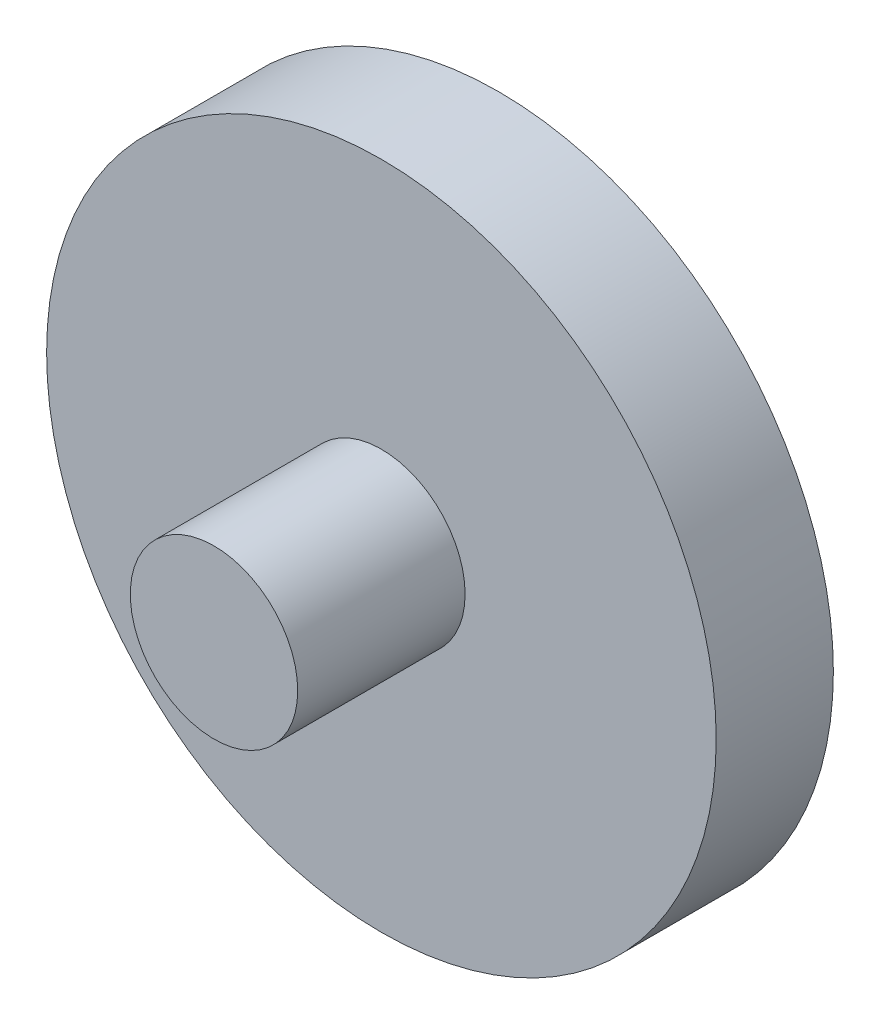
ISO-10303-21;
HEADER;
FILE_DESCRIPTION(('STEP AP214'),'2;1');
FILE_NAME('part.step','',(''),(''),'','','');
FILE_SCHEMA(('AUTOMOTIVE_DESIGN { 1 0 10303 214 1 1 1 1 }'));
ENDSEC;
DATA;
#1=APPLICATION_CONTEXT('core data for automotive mechanical design processes');
#2=APPLICATION_PROTOCOL_DEFINITION('international standard','automotive_design',2000,#1);
#3=PRODUCT_CONTEXT('',#1,'mechanical');
#4=PRODUCT('Part','Part','',(#3));
#5=PRODUCT_RELATED_PRODUCT_CATEGORY('part','',(#4));
#6=PRODUCT_DEFINITION_FORMATION('','',#4);
#7=PRODUCT_DEFINITION_CONTEXT('part definition',#1,'design');
#8=PRODUCT_DEFINITION('design','',#6,#7);
#9=PRODUCT_DEFINITION_SHAPE('','',#8);
#10=(LENGTH_UNIT() NAMED_UNIT(*) SI_UNIT(.MILLI.,.METRE.));
#11=(NAMED_UNIT(*) PLANE_ANGLE_UNIT() SI_UNIT($,.RADIAN.));
#12=(NAMED_UNIT(*) SI_UNIT($,.STERADIAN.) SOLID_ANGLE_UNIT());
#13=UNCERTAINTY_MEASURE_WITH_UNIT(LENGTH_MEASURE(1.E-05),#10,'distance_accuracy_value','');
#14=(GEOMETRIC_REPRESENTATION_CONTEXT(3) GLOBAL_UNCERTAINTY_ASSIGNED_CONTEXT((#13)) GLOBAL_UNIT_ASSIGNED_CONTEXT((#10,
#11,#12)) REPRESENTATION_CONTEXT('',''));
#15=CARTESIAN_POINT('',(0.,0.,0.));
#16=DIRECTION('',(0.,0.,1.));
#17=DIRECTION('',(1.,0.,0.));
#18=AXIS2_PLACEMENT_3D('',#15,#16,#17);
#19=CARTESIAN_POINT('',(0.,0.,7.));
#20=DIRECTION('',(0.,0.,-1.));
#21=DIRECTION('',(-1.,0.,0.));
#22=AXIS2_PLACEMENT_3D('',#19,#20,#21);
#23=CYLINDRICAL_SURFACE('',#22,20.);
#24=CARTESIAN_POINT('',(0.,0.,7.));
#25=DIRECTION('',(0.,0.,1.));
#26=DIRECTION('',(1.,0.,0.));
#27=AXIS2_PLACEMENT_3D('',#24,#25,#26);
#28=CIRCLE('',#27,20.);
#29=CARTESIAN_POINT('',(20.,0.,7.));
#30=VERTEX_POINT('',#29);
#31=EDGE_CURVE('E10',#30,#30,#28,.T.);
#32=ORIENTED_EDGE('',*,*,#31,.F.);
#33=EDGE_LOOP('',(#32));
#34=FACE_BOUND('',#33,.T.);
#35=CARTESIAN_POINT('',(0.,0.,0.));
#36=DIRECTION('',(0.,0.,1.));
#37=DIRECTION('',(1.,0.,0.));
#38=AXIS2_PLACEMENT_3D('',#35,#36,#37);
#39=CIRCLE('',#38,20.);
#40=CARTESIAN_POINT('',(20.,0.,0.));
#41=VERTEX_POINT('',#40);
#42=EDGE_CURVE('E34',#41,#41,#39,.T.);
#43=ORIENTED_EDGE('',*,*,#42,.T.);
#44=EDGE_LOOP('',(#43));
#45=FACE_BOUND('',#44,.T.);
#46=ADVANCED_FACE('F31',(#34,#45),#23,.T.);
#47=CARTESIAN_POINT('',(0.,0.,7.));
#48=DIRECTION('',(0.,0.,1.));
#49=DIRECTION('',(1.,0.,0.));
#50=AXIS2_PLACEMENT_3D('',#47,#48,#49);
#51=PLANE('',#50);
#52=CARTESIAN_POINT('',(0.,0.,7.));
#53=DIRECTION('',(0.,0.,1.));
#54=DIRECTION('',(1.,0.,0.));
#55=AXIS2_PLACEMENT_3D('',#52,#53,#54);
#56=CIRCLE('',#55,5.);
#57=CARTESIAN_POINT('',(5.,0.,7.));
#58=VERTEX_POINT('',#57);
#59=EDGE_CURVE('E43',#58,#58,#56,.T.);
#60=ORIENTED_EDGE('',*,*,#59,.F.);
#61=EDGE_LOOP('',(#60));
#62=FACE_BOUND('',#61,.T.);
#63=ORIENTED_EDGE('',*,*,#31,.T.);
#64=EDGE_LOOP('',(#63));
#65=FACE_BOUND('',#64,.T.);
#66=ADVANCED_FACE('F58',(#62,#65),#51,.T.);
#67=CARTESIAN_POINT('',(0.,0.,0.));
#68=DIRECTION('',(0.,0.,1.));
#69=DIRECTION('',(1.,0.,0.));
#70=AXIS2_PLACEMENT_3D('',#67,#68,#69);
#71=PLANE('',#70);
#72=ORIENTED_EDGE('',*,*,#42,.F.);
#73=EDGE_LOOP('',(#72));
#74=FACE_BOUND('',#73,.T.);
#75=ADVANCED_FACE('F54',(#74),#71,.F.);
#76=CARTESIAN_POINT('',(0.,0.,17.));
#77=DIRECTION('',(0.,0.,-1.));
#78=DIRECTION('',(-1.,0.,0.));
#79=AXIS2_PLACEMENT_3D('',#76,#77,#78);
#80=CYLINDRICAL_SURFACE('',#79,5.);
#81=CARTESIAN_POINT('',(0.,0.,17.));
#82=DIRECTION('',(0.,0.,1.));
#83=DIRECTION('',(1.,0.,0.));
#84=AXIS2_PLACEMENT_3D('',#81,#82,#83);
#85=CIRCLE('',#84,5.);
#86=CARTESIAN_POINT('',(5.,0.,17.));
#87=VERTEX_POINT('',#86);
#88=EDGE_CURVE('E41',#87,#87,#85,.T.);
#89=ORIENTED_EDGE('',*,*,#88,.F.);
#90=EDGE_LOOP('',(#89));
#91=FACE_BOUND('',#90,.T.);
#92=ORIENTED_EDGE('',*,*,#59,.T.);
#93=EDGE_LOOP('',(#92));
#94=FACE_BOUND('',#93,.T.);
#95=ADVANCED_FACE('F51',(#91,#94),#80,.T.);
#96=CARTESIAN_POINT('',(0.,0.,17.));
#97=DIRECTION('',(0.,0.,1.));
#98=DIRECTION('',(1.,0.,0.));
#99=AXIS2_PLACEMENT_3D('',#96,#97,#98);
#100=PLANE('',#99);
#101=ORIENTED_EDGE('',*,*,#88,.T.);
#102=EDGE_LOOP('',(#101));
#103=FACE_BOUND('',#102,.T.);
#104=ADVANCED_FACE('F49',(#103),#100,.T.);
#105=CLOSED_SHELL('',(#46,#66,#75,#95,#104));
#106=MANIFOLD_SOLID_BREP('B2',#105);
#107=ADVANCED_BREP_SHAPE_REPRESENTATION('',(#18,#106),#14);
#108=SHAPE_DEFINITION_REPRESENTATION(#9,#107);
ENDSEC;
END-ISO-10303-21;
